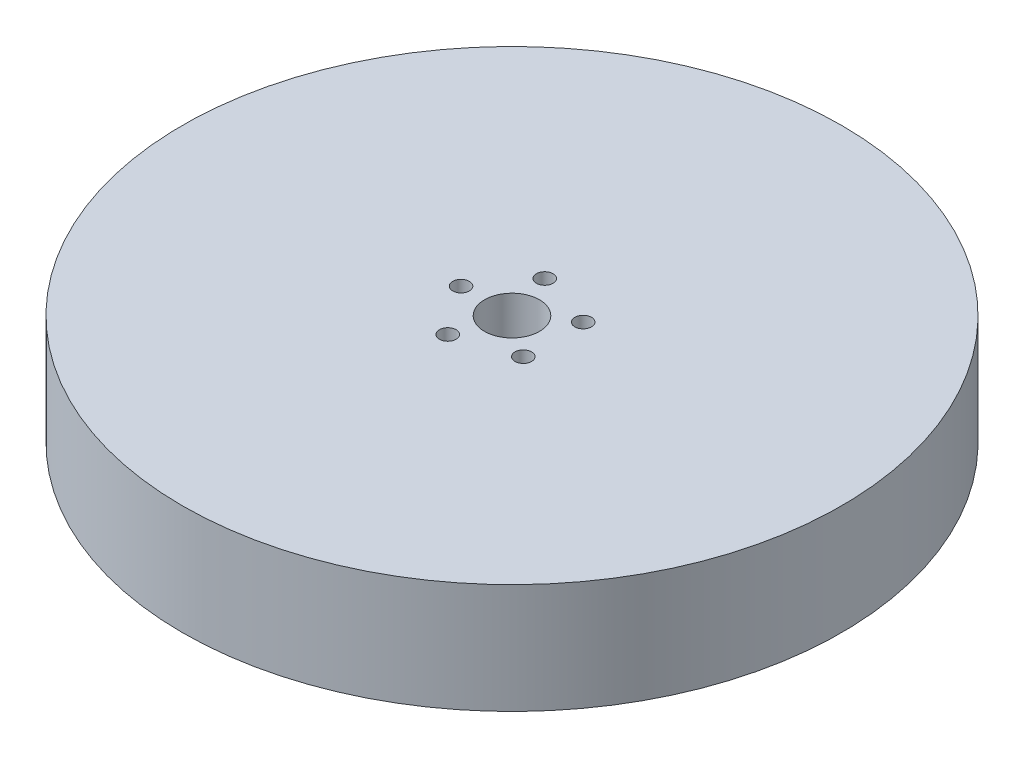
ISO-10303-21;
HEADER;
FILE_DESCRIPTION(('STEP AP214'),'2;1');
FILE_NAME('part.step','',(''),(''),'','','');
FILE_SCHEMA(('AUTOMOTIVE_DESIGN { 1 0 10303 214 1 1 1 1 }'));
ENDSEC;
DATA;
#1=APPLICATION_CONTEXT('core data for automotive mechanical design processes');
#2=APPLICATION_PROTOCOL_DEFINITION('international standard','automotive_design',2000,#1);
#3=PRODUCT_CONTEXT('',#1,'mechanical');
#4=PRODUCT('Part','Part','',(#3));
#5=PRODUCT_RELATED_PRODUCT_CATEGORY('part','',(#4));
#6=PRODUCT_DEFINITION_FORMATION('','',#4);
#7=PRODUCT_DEFINITION_CONTEXT('part definition',#1,'design');
#8=PRODUCT_DEFINITION('design','',#6,#7);
#9=PRODUCT_DEFINITION_SHAPE('','',#8);
#10=(LENGTH_UNIT() NAMED_UNIT(*) SI_UNIT(.MILLI.,.METRE.));
#11=(NAMED_UNIT(*) PLANE_ANGLE_UNIT() SI_UNIT($,.RADIAN.));
#12=(NAMED_UNIT(*) SI_UNIT($,.STERADIAN.) SOLID_ANGLE_UNIT());
#13=UNCERTAINTY_MEASURE_WITH_UNIT(LENGTH_MEASURE(1.E-05),#10,'distance_accuracy_value','');
#14=(GEOMETRIC_REPRESENTATION_CONTEXT(3) GLOBAL_UNCERTAINTY_ASSIGNED_CONTEXT((#13)) GLOBAL_UNIT_ASSIGNED_CONTEXT((#10,
#11,#12)) REPRESENTATION_CONTEXT('',''));
#15=CARTESIAN_POINT('',(0.,0.,0.));
#16=DIRECTION('',(0.,0.,1.));
#17=DIRECTION('',(1.,0.,0.));
#18=AXIS2_PLACEMENT_3D('',#15,#16,#17);
#19=CARTESIAN_POINT('',(0.,30.,0.));
#20=DIRECTION('',(0.,-1.,0.));
#21=DIRECTION('',(0.,0.,-1.));
#22=AXIS2_PLACEMENT_3D('',#19,#20,#21);
#23=CYLINDRICAL_SURFACE('',#22,90.);
#24=CARTESIAN_POINT('',(0.,30.,0.));
#25=DIRECTION('',(0.,1.,0.));
#26=DIRECTION('',(0.,0.,1.));
#27=AXIS2_PLACEMENT_3D('',#24,#25,#26);
#28=CIRCLE('',#27,90.);
#29=CARTESIAN_POINT('',(0.,30.,90.));
#30=VERTEX_POINT('',#29);
#31=EDGE_CURVE('E10',#30,#30,#28,.T.);
#32=ORIENTED_EDGE('',*,*,#31,.F.);
#33=EDGE_LOOP('',(#32));
#34=FACE_BOUND('',#33,.T.);
#35=CARTESIAN_POINT('',(0.,0.,0.));
#36=DIRECTION('',(0.,1.,0.));
#37=DIRECTION('',(0.,0.,1.));
#38=AXIS2_PLACEMENT_3D('',#35,#36,#37);
#39=CIRCLE('',#38,90.);
#40=CARTESIAN_POINT('',(0.,0.,90.));
#41=VERTEX_POINT('',#40);
#42=EDGE_CURVE('E37',#41,#41,#39,.T.);
#43=ORIENTED_EDGE('',*,*,#42,.T.);
#44=EDGE_LOOP('',(#43));
#45=FACE_BOUND('',#44,.T.);
#46=ADVANCED_FACE('F40',(#34,#45),#23,.T.);
#47=CARTESIAN_POINT('',(0.,30.,0.));
#48=DIRECTION('',(0.,1.,0.));
#49=DIRECTION('',(0.,0.,1.));
#50=AXIS2_PLACEMENT_3D('',#47,#48,#49);
#51=PLANE('',#50);
#52=CARTESIAN_POINT('',(-4.3006813842177,30.,13.236136294843));
#53=DIRECTION('',(0.,1.,0.));
#54=DIRECTION('',(0.951056516295155,0.,0.309016994374945));
#55=AXIS2_PLACEMENT_3D('',#52,#53,#54);
#56=CIRCLE('',#55,2.277172363583);
#57=CARTESIAN_POINT('',(-2.13496176910485,30.,13.9398212543111));
#58=VERTEX_POINT('',#57);
#59=EDGE_CURVE('E78',#58,#58,#56,.T.);
#60=ORIENTED_EDGE('',*,*,#59,.F.);
#61=EDGE_LOOP('',(#60));
#62=FACE_BOUND('',#61,.T.);
#63=CARTESIAN_POINT('',(11.259330038666,30.,8.18038210993901));
#64=DIRECTION('',(0.,1.,0.));
#65=DIRECTION('',(0.587785252292469,0.,-0.809016994374951));
#66=AXIS2_PLACEMENT_3D('',#63,#64,#65);
#67=CIRCLE('',#66,2.277172363583);
#68=CARTESIAN_POINT('',(12.5978183709081,30.,6.33811096867939));
#69=VERTEX_POINT('',#68);
#70=EDGE_CURVE('E71',#69,#69,#67,.T.);
#71=ORIENTED_EDGE('',*,*,#70,.F.);
#72=EDGE_LOOP('',(#71));
#73=FACE_BOUND('',#72,.T.);
#74=CARTESIAN_POINT('',(11.2593300386659,30.,-8.18038210993917));
#75=DIRECTION('',(0.,1.,0.));
#76=DIRECTION('',(-0.58778525229248,0.,-0.809016994374942));
#77=AXIS2_PLACEMENT_3D('',#74,#75,#76);
#78=CIRCLE('',#77,2.277172363583);
#79=CARTESIAN_POINT('',(9.9208417064238,30.,-10.0226532511988));
#80=VERTEX_POINT('',#79);
#81=EDGE_CURVE('E70',#80,#80,#78,.T.);
#82=ORIENTED_EDGE('',*,*,#81,.F.);
#83=EDGE_LOOP('',(#82));
#84=FACE_BOUND('',#83,.T.);
#85=CARTESIAN_POINT('',(-4.30068138421788,30.,-13.2361362948429));
#86=DIRECTION('',(0.,1.,0.));
#87=DIRECTION('',(-0.95105651629515,0.,0.309016994374958));
#88=AXIS2_PLACEMENT_3D('',#85,#86,#87);
#89=CIRCLE('',#88,2.277172363583);
#90=CARTESIAN_POINT('',(-6.46640099933072,30.,-12.5324513353748));
#91=VERTEX_POINT('',#90);
#92=EDGE_CURVE('E61',#91,#91,#89,.T.);
#93=ORIENTED_EDGE('',*,*,#92,.F.);
#94=EDGE_LOOP('',(#93));
#95=FACE_BOUND('',#94,.T.);
#96=CARTESIAN_POINT('',(-13.9172973088965,30.,0.));
#97=DIRECTION('',(0.,1.,0.));
#98=DIRECTION('',(0.,0.,1.));
#99=AXIS2_PLACEMENT_3D('',#96,#97,#98);
#100=CIRCLE('',#99,2.277172363583);
#101=CARTESIAN_POINT('',(-13.9172973088965,30.,2.277172363583));
#102=VERTEX_POINT('',#101);
#103=EDGE_CURVE('E54',#102,#102,#100,.T.);
#104=ORIENTED_EDGE('',*,*,#103,.F.);
#105=EDGE_LOOP('',(#104));
#106=FACE_BOUND('',#105,.T.);
#107=CARTESIAN_POINT('',(0.,30.,0.));
#108=DIRECTION('',(0.,1.,0.));
#109=DIRECTION('',(0.,0.,1.));
#110=AXIS2_PLACEMENT_3D('',#107,#108,#109);
#111=CIRCLE('',#110,7.5);
#112=CARTESIAN_POINT('',(0.,30.,7.5));
#113=VERTEX_POINT('',#112);
#114=EDGE_CURVE('E50',#113,#113,#111,.T.);
#115=ORIENTED_EDGE('',*,*,#114,.F.);
#116=EDGE_LOOP('',(#115));
#117=FACE_BOUND('',#116,.T.);
#118=ORIENTED_EDGE('',*,*,#31,.T.);
#119=EDGE_LOOP('',(#118));
#120=FACE_BOUND('',#119,.T.);
#121=ADVANCED_FACE('F94',(#62,#73,#84,#95,#106,#117,#120),#51,.T.);
#122=CARTESIAN_POINT('',(0.,0.,0.));
#123=DIRECTION('',(0.,1.,0.));
#124=DIRECTION('',(0.,0.,1.));
#125=AXIS2_PLACEMENT_3D('',#122,#123,#124);
#126=PLANE('',#125);
#127=CARTESIAN_POINT('',(0.,0.,0.));
#128=DIRECTION('',(0.,1.,0.));
#129=DIRECTION('',(0.,0.,1.));
#130=AXIS2_PLACEMENT_3D('',#127,#128,#129);
#131=CIRCLE('',#130,7.5);
#132=CARTESIAN_POINT('',(0.,0.,7.5));
#133=VERTEX_POINT('',#132);
#134=EDGE_CURVE('E47',#133,#133,#131,.T.);
#135=ORIENTED_EDGE('',*,*,#134,.T.);
#136=EDGE_LOOP('',(#135));
#137=FACE_BOUND('',#136,.T.);
#138=ORIENTED_EDGE('',*,*,#42,.F.);
#139=EDGE_LOOP('',(#138));
#140=FACE_BOUND('',#139,.T.);
#141=ADVANCED_FACE('F100',(#137,#140),#126,.F.);
#142=CARTESIAN_POINT('',(0.,30.,0.));
#143=DIRECTION('',(0.,-1.,0.));
#144=DIRECTION('',(0.,0.,-1.));
#145=AXIS2_PLACEMENT_3D('',#142,#143,#144);
#146=CYLINDRICAL_SURFACE('',#145,7.5);
#147=ORIENTED_EDGE('',*,*,#114,.T.);
#148=EDGE_LOOP('',(#147));
#149=FACE_BOUND('',#148,.T.);
#150=ORIENTED_EDGE('',*,*,#134,.F.);
#151=EDGE_LOOP('',(#150));
#152=FACE_BOUND('',#151,.T.);
#153=ADVANCED_FACE('F108',(#149,#152),#146,.F.);
#154=CARTESIAN_POINT('',(-13.9172973088965,6.90421414598448,0.));
#155=DIRECTION('',(0.,1.,0.));
#156=DIRECTION('',(0.,0.,1.));
#157=AXIS2_PLACEMENT_3D('',#154,#155,#156);
#158=CYLINDRICAL_SURFACE('',#157,2.277172363583);
#159=CARTESIAN_POINT('',(-13.9172973088965,6.90421414598448,0.));
#160=DIRECTION('',(0.,1.,0.));
#161=DIRECTION('',(0.,0.,1.));
#162=AXIS2_PLACEMENT_3D('',#159,#160,#161);
#163=CIRCLE('',#162,2.277172363583);
#164=CARTESIAN_POINT('',(-13.9172973088965,6.90421414598448,2.277172363583));
#165=VERTEX_POINT('',#164);
#166=EDGE_CURVE('E55',#165,#165,#163,.T.);
#167=ORIENTED_EDGE('',*,*,#166,.F.);
#168=EDGE_LOOP('',(#167));
#169=FACE_BOUND('',#168,.T.);
#170=ORIENTED_EDGE('',*,*,#103,.T.);
#171=EDGE_LOOP('',(#170));
#172=FACE_BOUND('',#171,.T.);
#173=ADVANCED_FACE('F115',(#169,#172),#158,.F.);
#174=CARTESIAN_POINT('',(-13.9172973088965,6.90421414598448,0.));
#175=DIRECTION('',(0.,1.,0.));
#176=DIRECTION('',(0.,0.,1.));
#177=AXIS2_PLACEMENT_3D('',#174,#175,#176);
#178=PLANE('',#177);
#179=ORIENTED_EDGE('',*,*,#166,.T.);
#180=EDGE_LOOP('',(#179));
#181=FACE_BOUND('',#180,.T.);
#182=ADVANCED_FACE('F142',(#181),#178,.T.);
#183=CARTESIAN_POINT('',(-4.30068138421788,6.90421414598448,-13.2361362948429));
#184=DIRECTION('',(0.,1.,0.));
#185=DIRECTION('',(0.,0.,1.));
#186=AXIS2_PLACEMENT_3D('',#183,#184,#185);
#187=CYLINDRICAL_SURFACE('',#186,2.277172363583);
#188=CARTESIAN_POINT('',(-4.30068138421788,6.90421414598448,-13.2361362948429));
#189=DIRECTION('',(0.,1.,0.));
#190=DIRECTION('',(-0.95105651629515,0.,0.309016994374958));
#191=AXIS2_PLACEMENT_3D('',#188,#189,#190);
#192=CIRCLE('',#191,2.277172363583);
#193=CARTESIAN_POINT('',(-6.46640099933072,6.90421414598448,-12.5324513353748));
#194=VERTEX_POINT('',#193);
#195=EDGE_CURVE('E63',#194,#194,#192,.T.);
#196=ORIENTED_EDGE('',*,*,#195,.F.);
#197=EDGE_LOOP('',(#196));
#198=FACE_BOUND('',#197,.T.);
#199=ORIENTED_EDGE('',*,*,#92,.T.);
#200=EDGE_LOOP('',(#199));
#201=FACE_BOUND('',#200,.T.);
#202=ADVANCED_FACE('F147',(#198,#201),#187,.F.);
#203=CARTESIAN_POINT('',(-4.30068138421788,6.90421414598448,-13.2361362948429));
#204=DIRECTION('',(0.,1.,0.));
#205=DIRECTION('',(-0.95105651629515,0.,0.309016994374958));
#206=AXIS2_PLACEMENT_3D('',#203,#204,#205);
#207=PLANE('',#206);
#208=ORIENTED_EDGE('',*,*,#195,.T.);
#209=EDGE_LOOP('',(#208));
#210=FACE_BOUND('',#209,.T.);
#211=ADVANCED_FACE('F163',(#210),#207,.T.);
#212=CARTESIAN_POINT('',(11.2593300386659,6.90421414598448,-8.18038210993917));
#213=DIRECTION('',(0.,1.,0.));
#214=DIRECTION('',(0.,0.,1.));
#215=AXIS2_PLACEMENT_3D('',#212,#213,#214);
#216=CYLINDRICAL_SURFACE('',#215,2.277172363583);
#217=CARTESIAN_POINT('',(11.2593300386659,6.90421414598448,-8.18038210993917));
#218=DIRECTION('',(0.,1.,0.));
#219=DIRECTION('',(-0.58778525229248,0.,-0.809016994374942));
#220=AXIS2_PLACEMENT_3D('',#217,#218,#219);
#221=CIRCLE('',#220,2.277172363583);
#222=CARTESIAN_POINT('',(9.9208417064238,6.90421414598448,-10.0226532511988));
#223=VERTEX_POINT('',#222);
#224=EDGE_CURVE('E69',#223,#223,#221,.T.);
#225=ORIENTED_EDGE('',*,*,#224,.F.);
#226=EDGE_LOOP('',(#225));
#227=FACE_BOUND('',#226,.T.);
#228=ORIENTED_EDGE('',*,*,#81,.T.);
#229=EDGE_LOOP('',(#228));
#230=FACE_BOUND('',#229,.T.);
#231=ADVANCED_FACE('F172',(#227,#230),#216,.F.);
#232=CARTESIAN_POINT('',(11.2593300386659,6.90421414598448,-8.18038210993917));
#233=DIRECTION('',(0.,1.,0.));
#234=DIRECTION('',(-0.58778525229248,0.,-0.809016994374942));
#235=AXIS2_PLACEMENT_3D('',#232,#233,#234);
#236=PLANE('',#235);
#237=ORIENTED_EDGE('',*,*,#224,.T.);
#238=EDGE_LOOP('',(#237));
#239=FACE_BOUND('',#238,.T.);
#240=ADVANCED_FACE('F185',(#239),#236,.T.);
#241=CARTESIAN_POINT('',(11.259330038666,6.90421414598448,8.18038210993901));
#242=DIRECTION('',(0.,1.,0.));
#243=DIRECTION('',(0.,0.,1.));
#244=AXIS2_PLACEMENT_3D('',#241,#242,#243);
#245=CYLINDRICAL_SURFACE('',#244,2.277172363583);
#246=CARTESIAN_POINT('',(11.259330038666,6.90421414598448,8.18038210993901));
#247=DIRECTION('',(0.,1.,0.));
#248=DIRECTION('',(0.587785252292469,0.,-0.809016994374951));
#249=AXIS2_PLACEMENT_3D('',#246,#247,#248);
#250=CIRCLE('',#249,2.277172363583);
#251=CARTESIAN_POINT('',(12.5978183709081,6.90421414598448,6.33811096867939));
#252=VERTEX_POINT('',#251);
#253=EDGE_CURVE('E76',#252,#252,#250,.T.);
#254=ORIENTED_EDGE('',*,*,#253,.F.);
#255=EDGE_LOOP('',(#254));
#256=FACE_BOUND('',#255,.T.);
#257=ORIENTED_EDGE('',*,*,#70,.T.);
#258=EDGE_LOOP('',(#257));
#259=FACE_BOUND('',#258,.T.);
#260=ADVANCED_FACE('F191',(#256,#259),#245,.F.);
#261=CARTESIAN_POINT('',(11.259330038666,6.90421414598448,8.18038210993901));
#262=DIRECTION('',(0.,1.,0.));
#263=DIRECTION('',(0.587785252292469,0.,-0.809016994374951));
#264=AXIS2_PLACEMENT_3D('',#261,#262,#263);
#265=PLANE('',#264);
#266=ORIENTED_EDGE('',*,*,#253,.T.);
#267=EDGE_LOOP('',(#266));
#268=FACE_BOUND('',#267,.T.);
#269=ADVANCED_FACE('F89',(#268),#265,.T.);
#270=CARTESIAN_POINT('',(-4.3006813842177,6.90421414598448,13.236136294843));
#271=DIRECTION('',(0.,1.,0.));
#272=DIRECTION('',(0.,0.,1.));
#273=AXIS2_PLACEMENT_3D('',#270,#271,#272);
#274=CYLINDRICAL_SURFACE('',#273,2.277172363583);
#275=CARTESIAN_POINT('',(-4.3006813842177,6.90421414598448,13.236136294843));
#276=DIRECTION('',(0.,1.,0.));
#277=DIRECTION('',(0.951056516295155,0.,0.309016994374945));
#278=AXIS2_PLACEMENT_3D('',#275,#276,#277);
#279=CIRCLE('',#278,2.277172363583);
#280=CARTESIAN_POINT('',(-2.13496176910485,6.90421414598448,13.9398212543111));
#281=VERTEX_POINT('',#280);
#282=EDGE_CURVE('E59',#281,#281,#279,.T.);
#283=ORIENTED_EDGE('',*,*,#282,.F.);
#284=EDGE_LOOP('',(#283));
#285=FACE_BOUND('',#284,.T.);
#286=ORIENTED_EDGE('',*,*,#59,.T.);
#287=EDGE_LOOP('',(#286));
#288=FACE_BOUND('',#287,.T.);
#289=ADVANCED_FACE('F87',(#285,#288),#274,.F.);
#290=CARTESIAN_POINT('',(-4.3006813842177,6.90421414598448,13.236136294843));
#291=DIRECTION('',(0.,1.,0.));
#292=DIRECTION('',(0.951056516295155,0.,0.309016994374945));
#293=AXIS2_PLACEMENT_3D('',#290,#291,#292);
#294=PLANE('',#293);
#295=ORIENTED_EDGE('',*,*,#282,.T.);
#296=EDGE_LOOP('',(#295));
#297=FACE_BOUND('',#296,.T.);
#298=ADVANCED_FACE('F84',(#297),#294,.T.);
#299=CLOSED_SHELL('',(#46,#121,#141,#153,#173,#182,#202,#211,#231,#240,#260,#269,#289,#298));
#300=MANIFOLD_SOLID_BREP('B2',#299);
#301=ADVANCED_BREP_SHAPE_REPRESENTATION('',(#18,#300),#14);
#302=SHAPE_DEFINITION_REPRESENTATION(#9,#301);
ENDSEC;
END-ISO-10303-21;
